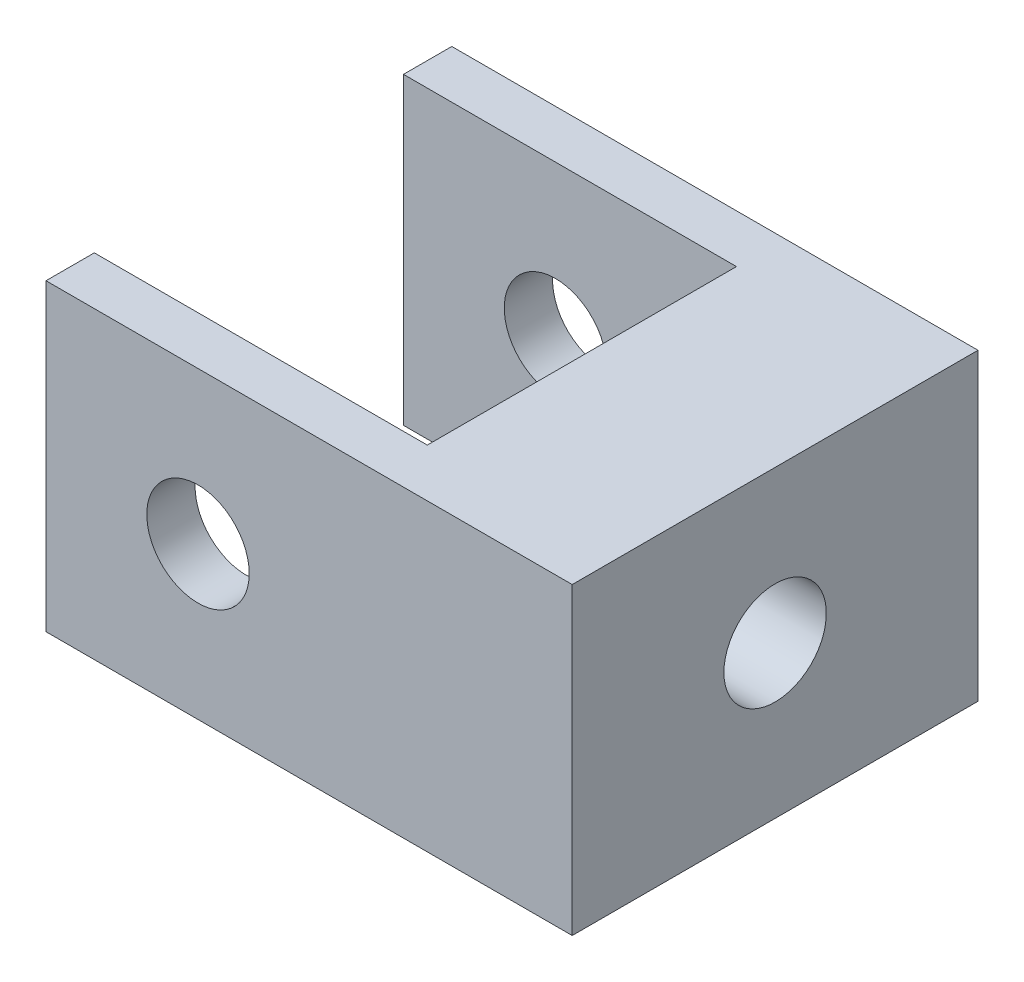
ISO-10303-21;
HEADER;
FILE_DESCRIPTION(('STEP AP214'),'2;1');
FILE_NAME('part.step','',(''),(''),'','','');
FILE_SCHEMA(('AUTOMOTIVE_DESIGN { 1 0 10303 214 1 1 1 1 }'));
ENDSEC;
DATA;
#1=APPLICATION_CONTEXT('core data for automotive mechanical design processes');
#2=APPLICATION_PROTOCOL_DEFINITION('international standard','automotive_design',2000,#1);
#3=PRODUCT_CONTEXT('',#1,'mechanical');
#4=PRODUCT('Part','Part','',(#3));
#5=PRODUCT_RELATED_PRODUCT_CATEGORY('part','',(#4));
#6=PRODUCT_DEFINITION_FORMATION('','',#4);
#7=PRODUCT_DEFINITION_CONTEXT('part definition',#1,'design');
#8=PRODUCT_DEFINITION('design','',#6,#7);
#9=PRODUCT_DEFINITION_SHAPE('','',#8);
#10=(LENGTH_UNIT() NAMED_UNIT(*) SI_UNIT(.MILLI.,.METRE.));
#11=(NAMED_UNIT(*) PLANE_ANGLE_UNIT() SI_UNIT($,.RADIAN.));
#12=(NAMED_UNIT(*) SI_UNIT($,.STERADIAN.) SOLID_ANGLE_UNIT());
#13=UNCERTAINTY_MEASURE_WITH_UNIT(LENGTH_MEASURE(1.E-05),#10,'distance_accuracy_value','');
#14=(GEOMETRIC_REPRESENTATION_CONTEXT(3) GLOBAL_UNCERTAINTY_ASSIGNED_CONTEXT((#13)) GLOBAL_UNIT_ASSIGNED_CONTEXT((#10,
#11,#12)) REPRESENTATION_CONTEXT('',''));
#15=CARTESIAN_POINT('',(0.,0.,0.));
#16=DIRECTION('',(0.,0.,1.));
#17=DIRECTION('',(1.,0.,0.));
#18=AXIS2_PLACEMENT_3D('',#15,#16,#17);
#19=CARTESIAN_POINT('',(-7.86619772367581,0.,10.5));
#20=DIRECTION('',(1.,0.,0.));
#21=DIRECTION('',(0.,0.,-1.));
#22=AXIS2_PLACEMENT_3D('',#19,#20,#21);
#23=PLANE('',#22);
#24=DIRECTION('',(0.,-1.,0.));
#25=VECTOR('',#24,1.);
#26=CARTESIAN_POINT('',(-7.86619772367581,0.,-8.));
#27=LINE('',#26,#25);
#28=CARTESIAN_POINT('',(-7.86619772367581,7.86619772367581,-8.));
#29=VERTEX_POINT('',#28);
#30=CARTESIAN_POINT('',(-7.86619772367581,-7.86619772367581,-8.));
#31=VERTEX_POINT('',#30);
#32=EDGE_CURVE('E111',#29,#31,#27,.T.);
#33=ORIENTED_EDGE('',*,*,#32,.F.);
#34=DIRECTION('',(0.,0.,-1.));
#35=VECTOR('',#34,1.);
#36=CARTESIAN_POINT('',(-7.86619772367581,7.86619772367581,10.5));
#37=LINE('',#36,#35);
#38=CARTESIAN_POINT('',(-7.86619772367581,7.86619772367581,-10.5));
#39=VERTEX_POINT('',#38);
#40=EDGE_CURVE('E82',#29,#39,#37,.T.);
#41=ORIENTED_EDGE('',*,*,#40,.T.);
#42=DIRECTION('',(0.,-1.,0.));
#43=VECTOR('',#42,1.);
#44=CARTESIAN_POINT('',(-7.86619772367581,0.,-10.5));
#45=LINE('',#44,#43);
#46=CARTESIAN_POINT('',(-7.86619772367581,-7.86619772367581,-10.5));
#47=VERTEX_POINT('',#46);
#48=EDGE_CURVE('E130',#39,#47,#45,.T.);
#49=ORIENTED_EDGE('',*,*,#48,.T.);
#50=DIRECTION('',(0.,0.,-1.));
#51=VECTOR('',#50,1.);
#52=CARTESIAN_POINT('',(-7.86619772367581,-7.86619772367581,10.5));
#53=LINE('',#52,#51);
#54=EDGE_CURVE('E43',#31,#47,#53,.T.);
#55=ORIENTED_EDGE('',*,*,#54,.F.);
#56=EDGE_LOOP('',(#33,#41,#49,#55));
#57=FACE_BOUND('',#56,.T.);
#58=ADVANCED_FACE('F34',(#57),#23,.F.);
#59=CARTESIAN_POINT('',(0.,-7.86619772367581,10.5));
#60=DIRECTION('',(0.,1.,0.));
#61=DIRECTION('',(0.,0.,1.));
#62=AXIS2_PLACEMENT_3D('',#59,#60,#61);
#63=PLANE('',#62);
#64=DIRECTION('',(1.,0.,0.));
#65=VECTOR('',#64,1.);
#66=CARTESIAN_POINT('',(0.,-7.86619772367581,-8.));
#67=LINE('',#66,#65);
#68=CARTESIAN_POINT('',(9.36619772367581,-7.86619772367582,-8.));
#69=VERTEX_POINT('',#68);
#70=EDGE_CURVE('E115',#31,#69,#67,.T.);
#71=ORIENTED_EDGE('',*,*,#70,.F.);
#72=ORIENTED_EDGE('',*,*,#54,.T.);
#73=DIRECTION('',(1.,0.,0.));
#74=VECTOR('',#73,1.);
#75=CARTESIAN_POINT('',(0.,-7.86619772367581,-10.5));
#76=LINE('',#75,#74);
#77=CARTESIAN_POINT('',(19.3661977236758,-7.86619772367582,-10.5));
#78=VERTEX_POINT('',#77);
#79=EDGE_CURVE('E145',#47,#78,#76,.T.);
#80=ORIENTED_EDGE('',*,*,#79,.T.);
#81=DIRECTION('',(0.,0.,-1.));
#82=VECTOR('',#81,1.);
#83=CARTESIAN_POINT('',(19.3661977236758,-7.86619772367582,10.5));
#84=LINE('',#83,#82);
#85=CARTESIAN_POINT('',(19.3661977236758,-7.86619772367582,10.5));
#86=VERTEX_POINT('',#85);
#87=EDGE_CURVE('E131',#86,#78,#84,.T.);
#88=ORIENTED_EDGE('',*,*,#87,.F.);
#89=DIRECTION('',(1.,0.,0.));
#90=VECTOR('',#89,1.);
#91=CARTESIAN_POINT('',(0.,-7.86619772367581,10.5));
#92=LINE('',#91,#90);
#93=CARTESIAN_POINT('',(-7.86619772367581,-7.86619772367581,10.5));
#94=VERTEX_POINT('',#93);
#95=EDGE_CURVE('E89',#94,#86,#92,.T.);
#96=ORIENTED_EDGE('',*,*,#95,.F.);
#97=CARTESIAN_POINT('',(-7.86619772367581,-7.86619772367581,8.));
#98=VERTEX_POINT('',#97);
#99=EDGE_CURVE('E11',#94,#98,#53,.T.);
#100=ORIENTED_EDGE('',*,*,#99,.T.);
#101=DIRECTION('',(1.,0.,0.));
#102=VECTOR('',#101,1.);
#103=CARTESIAN_POINT('',(0.,-7.86619772367581,8.));
#104=LINE('',#103,#102);
#105=CARTESIAN_POINT('',(9.36619772367581,-7.86619772367582,8.));
#106=VERTEX_POINT('',#105);
#107=EDGE_CURVE('E161',#98,#106,#104,.T.);
#108=ORIENTED_EDGE('',*,*,#107,.T.);
#109=DIRECTION('',(0.,0.,1.));
#110=VECTOR('',#109,1.);
#111=CARTESIAN_POINT('',(9.36619772367581,-7.86619772367582,-8.));
#112=LINE('',#111,#110);
#113=EDGE_CURVE('E126',#69,#106,#112,.T.);
#114=ORIENTED_EDGE('',*,*,#113,.F.);
#115=EDGE_LOOP('',(#71,#72,#80,#88,#96,#100,#108,#114));
#116=FACE_BOUND('',#115,.T.);
#117=ADVANCED_FACE('F122',(#116),#63,.F.);
#118=CARTESIAN_POINT('',(0.,7.86619772367581,10.5));
#119=DIRECTION('',(0.,-1.,0.));
#120=DIRECTION('',(1.,0.,0.));
#121=AXIS2_PLACEMENT_3D('',#118,#119,#120);
#122=PLANE('',#121);
#123=DIRECTION('',(-1.,0.,0.));
#124=VECTOR('',#123,1.);
#125=CARTESIAN_POINT('',(0.,7.86619772367581,-8.));
#126=LINE('',#125,#124);
#127=CARTESIAN_POINT('',(9.36619772367581,7.86619772367582,-8.));
#128=VERTEX_POINT('',#127);
#129=EDGE_CURVE('E118',#128,#29,#126,.T.);
#130=ORIENTED_EDGE('',*,*,#129,.F.);
#131=DIRECTION('',(0.,0.,1.));
#132=VECTOR('',#131,1.);
#133=CARTESIAN_POINT('',(9.36619772367581,7.86619772367582,-8.));
#134=LINE('',#133,#132);
#135=CARTESIAN_POINT('',(9.36619772367581,7.86619772367582,8.));
#136=VERTEX_POINT('',#135);
#137=EDGE_CURVE('E148',#128,#136,#134,.T.);
#138=ORIENTED_EDGE('',*,*,#137,.T.);
#139=DIRECTION('',(-1.,0.,0.));
#140=VECTOR('',#139,1.);
#141=CARTESIAN_POINT('',(0.,7.86619772367581,8.));
#142=LINE('',#141,#140);
#143=CARTESIAN_POINT('',(-7.86619772367581,7.86619772367581,8.));
#144=VERTEX_POINT('',#143);
#145=EDGE_CURVE('E120',#136,#144,#142,.T.);
#146=ORIENTED_EDGE('',*,*,#145,.T.);
#147=CARTESIAN_POINT('',(-7.86619772367581,7.86619772367581,10.5));
#148=VERTEX_POINT('',#147);
#149=EDGE_CURVE('E136',#148,#144,#37,.T.);
#150=ORIENTED_EDGE('',*,*,#149,.F.);
#151=DIRECTION('',(-1.,0.,0.));
#152=VECTOR('',#151,1.);
#153=CARTESIAN_POINT('',(0.,7.86619772367581,10.5));
#154=LINE('',#153,#152);
#155=CARTESIAN_POINT('',(19.3661977236758,7.86619772367582,10.5));
#156=VERTEX_POINT('',#155);
#157=EDGE_CURVE('E59',#156,#148,#154,.T.);
#158=ORIENTED_EDGE('',*,*,#157,.F.);
#159=DIRECTION('',(0.,0.,-1.));
#160=VECTOR('',#159,1.);
#161=CARTESIAN_POINT('',(19.3661977236758,7.86619772367582,10.5));
#162=LINE('',#161,#160);
#163=CARTESIAN_POINT('',(19.3661977236758,7.86619772367582,-10.5));
#164=VERTEX_POINT('',#163);
#165=EDGE_CURVE('E132',#156,#164,#162,.T.);
#166=ORIENTED_EDGE('',*,*,#165,.T.);
#167=DIRECTION('',(-1.,0.,0.));
#168=VECTOR('',#167,1.);
#169=CARTESIAN_POINT('',(0.,7.86619772367581,-10.5));
#170=LINE('',#169,#168);
#171=EDGE_CURVE('E139',#164,#39,#170,.T.);
#172=ORIENTED_EDGE('',*,*,#171,.T.);
#173=ORIENTED_EDGE('',*,*,#40,.F.);
#174=EDGE_LOOP('',(#130,#138,#146,#150,#158,#166,#172,#173));
#175=FACE_BOUND('',#174,.T.);
#176=ADVANCED_FACE('F204',(#175),#122,.F.);
#177=ORIENTED_EDGE('',*,*,#149,.T.);
#178=DIRECTION('',(0.,-1.,0.));
#179=VECTOR('',#178,1.);
#180=CARTESIAN_POINT('',(-7.86619772367581,0.,8.));
#181=LINE('',#180,#179);
#182=EDGE_CURVE('E50',#144,#98,#181,.T.);
#183=ORIENTED_EDGE('',*,*,#182,.T.);
#184=ORIENTED_EDGE('',*,*,#99,.F.);
#185=DIRECTION('',(0.,-1.,0.));
#186=VECTOR('',#185,1.);
#187=CARTESIAN_POINT('',(-7.86619772367581,0.,10.5));
#188=LINE('',#187,#186);
#189=EDGE_CURVE('E141',#148,#94,#188,.T.);
#190=ORIENTED_EDGE('',*,*,#189,.F.);
#191=EDGE_LOOP('',(#177,#183,#184,#190));
#192=FACE_BOUND('',#191,.T.);
#193=ADVANCED_FACE('F36',(#192),#23,.F.);
#194=CARTESIAN_POINT('',(19.3661977236758,0.,10.5));
#195=DIRECTION('',(1.,0.,0.));
#196=DIRECTION('',(0.,0.,-1.));
#197=AXIS2_PLACEMENT_3D('',#194,#195,#196);
#198=PLANE('',#197);
#199=CARTESIAN_POINT('',(19.3661977236758,0.,0.));
#200=DIRECTION('',(-1.,0.,0.));
#201=DIRECTION('',(0.,0.,1.));
#202=AXIS2_PLACEMENT_3D('',#199,#200,#201);
#203=CIRCLE('',#202,2.65);
#204=CARTESIAN_POINT('',(19.3661977236758,0.,2.65));
#205=VERTEX_POINT('',#204);
#206=EDGE_CURVE('E164',#205,#205,#203,.T.);
#207=ORIENTED_EDGE('',*,*,#206,.T.);
#208=EDGE_LOOP('',(#207));
#209=FACE_BOUND('',#208,.T.);
#210=DIRECTION('',(0.,-1.,0.));
#211=VECTOR('',#210,1.);
#212=CARTESIAN_POINT('',(19.3661977236758,0.,-10.5));
#213=LINE('',#212,#211);
#214=EDGE_CURVE('E142',#164,#78,#213,.T.);
#215=ORIENTED_EDGE('',*,*,#214,.F.);
#216=ORIENTED_EDGE('',*,*,#165,.F.);
#217=DIRECTION('',(0.,-1.,0.));
#218=VECTOR('',#217,1.);
#219=CARTESIAN_POINT('',(19.3661977236758,0.,10.5));
#220=LINE('',#219,#218);
#221=EDGE_CURVE('E150',#156,#86,#220,.T.);
#222=ORIENTED_EDGE('',*,*,#221,.T.);
#223=ORIENTED_EDGE('',*,*,#87,.T.);
#224=EDGE_LOOP('',(#215,#216,#222,#223));
#225=FACE_BOUND('',#224,.T.);
#226=ADVANCED_FACE('F194',(#209,#225),#198,.T.);
#227=CARTESIAN_POINT('',(0.,0.,10.5));
#228=DIRECTION('',(0.,0.,1.));
#229=DIRECTION('',(1.,0.,0.));
#230=AXIS2_PLACEMENT_3D('',#227,#228,#229);
#231=PLANE('',#230);
#232=CARTESIAN_POINT('',(0.,0.,10.5));
#233=DIRECTION('',(0.,0.,1.));
#234=DIRECTION('',(1.,0.,0.));
#235=AXIS2_PLACEMENT_3D('',#232,#233,#234);
#236=CIRCLE('',#235,2.64999999999999);
#237=CARTESIAN_POINT('',(2.64999999999999,0.,10.5));
#238=VERTEX_POINT('',#237);
#239=EDGE_CURVE('E184',#238,#238,#236,.T.);
#240=ORIENTED_EDGE('',*,*,#239,.F.);
#241=EDGE_LOOP('',(#240));
#242=FACE_BOUND('',#241,.T.);
#243=ORIENTED_EDGE('',*,*,#189,.T.);
#244=ORIENTED_EDGE('',*,*,#95,.T.);
#245=ORIENTED_EDGE('',*,*,#221,.F.);
#246=ORIENTED_EDGE('',*,*,#157,.T.);
#247=EDGE_LOOP('',(#243,#244,#245,#246));
#248=FACE_BOUND('',#247,.T.);
#249=ADVANCED_FACE('F191',(#242,#248),#231,.T.);
#250=CARTESIAN_POINT('',(0.,0.,-10.5));
#251=DIRECTION('',(0.,0.,1.));
#252=DIRECTION('',(1.,0.,0.));
#253=AXIS2_PLACEMENT_3D('',#250,#251,#252);
#254=PLANE('',#253);
#255=CARTESIAN_POINT('',(0.,0.,-10.5));
#256=DIRECTION('',(0.,0.,1.));
#257=DIRECTION('',(1.,0.,0.));
#258=AXIS2_PLACEMENT_3D('',#255,#256,#257);
#259=CIRCLE('',#258,2.65);
#260=CARTESIAN_POINT('',(2.65,0.,-10.5));
#261=VERTEX_POINT('',#260);
#262=EDGE_CURVE('E181',#261,#261,#259,.T.);
#263=ORIENTED_EDGE('',*,*,#262,.T.);
#264=EDGE_LOOP('',(#263));
#265=FACE_BOUND('',#264,.T.);
#266=ORIENTED_EDGE('',*,*,#48,.F.);
#267=ORIENTED_EDGE('',*,*,#171,.F.);
#268=ORIENTED_EDGE('',*,*,#214,.T.);
#269=ORIENTED_EDGE('',*,*,#79,.F.);
#270=EDGE_LOOP('',(#266,#267,#268,#269));
#271=FACE_BOUND('',#270,.T.);
#272=ADVANCED_FACE('F193',(#265,#271),#254,.F.);
#273=CARTESIAN_POINT('',(9.36619772367581,0.,-8.));
#274=DIRECTION('',(1.,0.,0.));
#275=DIRECTION('',(0.,0.,-1.));
#276=AXIS2_PLACEMENT_3D('',#273,#274,#275);
#277=PLANE('',#276);
#278=CARTESIAN_POINT('',(9.36619772367581,0.,0.));
#279=DIRECTION('',(-1.,0.,0.));
#280=DIRECTION('',(0.,0.,1.));
#281=AXIS2_PLACEMENT_3D('',#278,#279,#280);
#282=CIRCLE('',#281,5.);
#283=CARTESIAN_POINT('',(9.36619772367581,0.,5.));
#284=VERTEX_POINT('',#283);
#285=EDGE_CURVE('E175',#284,#284,#282,.T.);
#286=ORIENTED_EDGE('',*,*,#285,.F.);
#287=EDGE_LOOP('',(#286));
#288=FACE_BOUND('',#287,.T.);
#289=DIRECTION('',(0.,1.,0.));
#290=VECTOR('',#289,1.);
#291=CARTESIAN_POINT('',(9.36619772367581,0.,8.));
#292=LINE('',#291,#290);
#293=EDGE_CURVE('E159',#106,#136,#292,.T.);
#294=ORIENTED_EDGE('',*,*,#293,.T.);
#295=ORIENTED_EDGE('',*,*,#137,.F.);
#296=DIRECTION('',(0.,1.,0.));
#297=VECTOR('',#296,1.);
#298=CARTESIAN_POINT('',(9.36619772367581,0.,-8.));
#299=LINE('',#298,#297);
#300=EDGE_CURVE('E127',#69,#128,#299,.T.);
#301=ORIENTED_EDGE('',*,*,#300,.F.);
#302=ORIENTED_EDGE('',*,*,#113,.T.);
#303=EDGE_LOOP('',(#294,#295,#301,#302));
#304=FACE_BOUND('',#303,.T.);
#305=ADVANCED_FACE('F202',(#288,#304),#277,.F.);
#306=CARTESIAN_POINT('',(0.,0.,-8.));
#307=DIRECTION('',(0.,0.,1.));
#308=DIRECTION('',(1.,0.,0.));
#309=AXIS2_PLACEMENT_3D('',#306,#307,#308);
#310=PLANE('',#309);
#311=CARTESIAN_POINT('',(0.,0.,-8.));
#312=DIRECTION('',(0.,0.,1.));
#313=DIRECTION('',(1.,0.,0.));
#314=AXIS2_PLACEMENT_3D('',#311,#312,#313);
#315=CIRCLE('',#314,2.64999999999999);
#316=CARTESIAN_POINT('',(2.64999999999999,0.,-8.));
#317=VERTEX_POINT('',#316);
#318=EDGE_CURVE('E178',#317,#317,#315,.T.);
#319=ORIENTED_EDGE('',*,*,#318,.F.);
#320=EDGE_LOOP('',(#319));
#321=FACE_BOUND('',#320,.T.);
#322=ORIENTED_EDGE('',*,*,#32,.T.);
#323=ORIENTED_EDGE('',*,*,#70,.T.);
#324=ORIENTED_EDGE('',*,*,#300,.T.);
#325=ORIENTED_EDGE('',*,*,#129,.T.);
#326=EDGE_LOOP('',(#322,#323,#324,#325));
#327=FACE_BOUND('',#326,.T.);
#328=ADVANCED_FACE('F113',(#321,#327),#310,.T.);
#329=CARTESIAN_POINT('',(0.,0.,8.));
#330=DIRECTION('',(0.,0.,1.));
#331=DIRECTION('',(1.,0.,0.));
#332=AXIS2_PLACEMENT_3D('',#329,#330,#331);
#333=PLANE('',#332);
#334=CARTESIAN_POINT('',(0.,0.,8.));
#335=DIRECTION('',(0.,0.,1.));
#336=DIRECTION('',(1.,0.,0.));
#337=AXIS2_PLACEMENT_3D('',#334,#335,#336);
#338=CIRCLE('',#337,2.64999999999999);
#339=CARTESIAN_POINT('',(2.64999999999999,0.,8.));
#340=VERTEX_POINT('',#339);
#341=EDGE_CURVE('E38',#340,#340,#338,.T.);
#342=ORIENTED_EDGE('',*,*,#341,.T.);
#343=EDGE_LOOP('',(#342));
#344=FACE_BOUND('',#343,.T.);
#345=ORIENTED_EDGE('',*,*,#182,.F.);
#346=ORIENTED_EDGE('',*,*,#145,.F.);
#347=ORIENTED_EDGE('',*,*,#293,.F.);
#348=ORIENTED_EDGE('',*,*,#107,.F.);
#349=EDGE_LOOP('',(#345,#346,#347,#348));
#350=FACE_BOUND('',#349,.T.);
#351=ADVANCED_FACE('F200',(#344,#350),#333,.F.);
#352=CARTESIAN_POINT('',(9.36619772367581,0.,0.));
#353=DIRECTION('',(-1.,0.,0.));
#354=DIRECTION('',(0.,0.,1.));
#355=AXIS2_PLACEMENT_3D('',#352,#353,#354);
#356=CYLINDRICAL_SURFACE('',#355,2.65);
#357=ORIENTED_EDGE('',*,*,#206,.F.);
#358=EDGE_LOOP('',(#357));
#359=FACE_BOUND('',#358,.T.);
#360=CARTESIAN_POINT('',(14.3661977236758,0.,0.));
#361=DIRECTION('',(-1.,0.,0.));
#362=DIRECTION('',(0.,0.,1.));
#363=AXIS2_PLACEMENT_3D('',#360,#361,#362);
#364=CIRCLE('',#363,2.65);
#365=CARTESIAN_POINT('',(14.3661977236758,0.,2.65));
#366=VERTEX_POINT('',#365);
#367=EDGE_CURVE('E169',#366,#366,#364,.T.);
#368=ORIENTED_EDGE('',*,*,#367,.T.);
#369=EDGE_LOOP('',(#368));
#370=FACE_BOUND('',#369,.T.);
#371=ADVANCED_FACE('F234',(#359,#370),#356,.F.);
#372=CARTESIAN_POINT('',(14.3661977236758,2.65,0.));
#373=DIRECTION('',(1.,0.,0.));
#374=DIRECTION('',(0.,0.,-1.));
#375=AXIS2_PLACEMENT_3D('',#372,#373,#374);
#376=PLANE('',#375);
#377=ORIENTED_EDGE('',*,*,#367,.F.);
#378=EDGE_LOOP('',(#377));
#379=FACE_BOUND('',#378,.T.);
#380=CARTESIAN_POINT('',(14.3661977236758,0.,0.));
#381=DIRECTION('',(-1.,0.,0.));
#382=DIRECTION('',(0.,0.,1.));
#383=AXIS2_PLACEMENT_3D('',#380,#381,#382);
#384=CIRCLE('',#383,5.);
#385=CARTESIAN_POINT('',(14.3661977236758,0.,5.));
#386=VERTEX_POINT('',#385);
#387=EDGE_CURVE('E172',#386,#386,#384,.T.);
#388=ORIENTED_EDGE('',*,*,#387,.T.);
#389=EDGE_LOOP('',(#388));
#390=FACE_BOUND('',#389,.T.);
#391=ADVANCED_FACE('F241',(#379,#390),#376,.F.);
#392=CARTESIAN_POINT('',(9.36619772367581,0.,0.));
#393=DIRECTION('',(-1.,0.,0.));
#394=DIRECTION('',(0.,0.,1.));
#395=AXIS2_PLACEMENT_3D('',#392,#393,#394);
#396=CYLINDRICAL_SURFACE('',#395,5.);
#397=ORIENTED_EDGE('',*,*,#387,.F.);
#398=EDGE_LOOP('',(#397));
#399=FACE_BOUND('',#398,.T.);
#400=ORIENTED_EDGE('',*,*,#285,.T.);
#401=EDGE_LOOP('',(#400));
#402=FACE_BOUND('',#401,.T.);
#403=ADVANCED_FACE('F245',(#399,#402),#396,.F.);
#404=CARTESIAN_POINT('',(0.,0.,10.5));
#405=DIRECTION('',(0.,0.,1.));
#406=DIRECTION('',(1.,0.,0.));
#407=AXIS2_PLACEMENT_3D('',#404,#405,#406);
#408=CYLINDRICAL_SURFACE('',#407,2.64999999999999);
#409=ORIENTED_EDGE('',*,*,#239,.T.);
#410=EDGE_LOOP('',(#409));
#411=FACE_BOUND('',#410,.T.);
#412=ORIENTED_EDGE('',*,*,#341,.F.);
#413=EDGE_LOOP('',(#412));
#414=FACE_BOUND('',#413,.T.);
#415=ADVANCED_FACE('F188',(#411,#414),#408,.F.);
#416=ORIENTED_EDGE('',*,*,#318,.T.);
#417=EDGE_LOOP('',(#416));
#418=FACE_BOUND('',#417,.T.);
#419=ORIENTED_EDGE('',*,*,#262,.F.);
#420=EDGE_LOOP('',(#419));
#421=FACE_BOUND('',#420,.T.);
#422=ADVANCED_FACE('F250',(#418,#421),#408,.F.);
#423=CLOSED_SHELL('',(#58,#117,#176,#193,#226,#249,#272,#305,#328,#351,#371,#391,#403,#415,#422));
#424=MANIFOLD_SOLID_BREP('B2',#423);
#425=ADVANCED_BREP_SHAPE_REPRESENTATION('',(#18,#424),#14);
#426=SHAPE_DEFINITION_REPRESENTATION(#9,#425);
ENDSEC;
END-ISO-10303-21;
